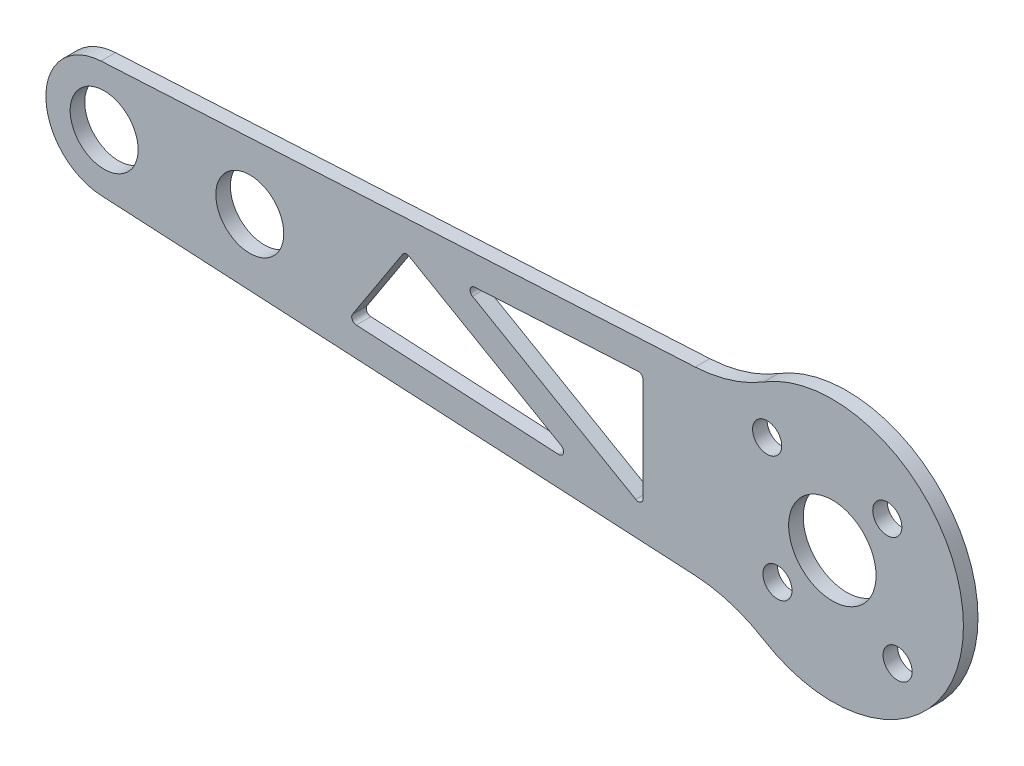
ISO-10303-21;
HEADER;
FILE_DESCRIPTION(('STEP AP214'),'2;1');
FILE_NAME('part.step','',(''),(''),'','','');
FILE_SCHEMA(('AUTOMOTIVE_DESIGN { 1 0 10303 214 1 1 1 1 }'));
ENDSEC;
DATA;
#1=APPLICATION_CONTEXT('core data for automotive mechanical design processes');
#2=APPLICATION_PROTOCOL_DEFINITION('international standard','automotive_design',2000,#1);
#3=PRODUCT_CONTEXT('',#1,'mechanical');
#4=PRODUCT('Part','Part','',(#3));
#5=PRODUCT_RELATED_PRODUCT_CATEGORY('part','',(#4));
#6=PRODUCT_DEFINITION_FORMATION('','',#4);
#7=PRODUCT_DEFINITION_CONTEXT('part definition',#1,'design');
#8=PRODUCT_DEFINITION('design','',#6,#7);
#9=PRODUCT_DEFINITION_SHAPE('','',#8);
#10=(LENGTH_UNIT() NAMED_UNIT(*) SI_UNIT(.MILLI.,.METRE.));
#11=(NAMED_UNIT(*) PLANE_ANGLE_UNIT() SI_UNIT($,.RADIAN.));
#12=(NAMED_UNIT(*) SI_UNIT($,.STERADIAN.) SOLID_ANGLE_UNIT());
#13=UNCERTAINTY_MEASURE_WITH_UNIT(LENGTH_MEASURE(1.E-05),#10,'distance_accuracy_value','');
#14=(GEOMETRIC_REPRESENTATION_CONTEXT(3) GLOBAL_UNCERTAINTY_ASSIGNED_CONTEXT((#13)) GLOBAL_UNIT_ASSIGNED_CONTEXT((#10,
#11,#12)) REPRESENTATION_CONTEXT('',''));
#15=CARTESIAN_POINT('',(0.,0.,0.));
#16=DIRECTION('',(0.,0.,1.));
#17=DIRECTION('',(1.,0.,0.));
#18=AXIS2_PLACEMENT_3D('',#15,#16,#17);
#19=CARTESIAN_POINT('',(-75.,0.,1.5));
#20=DIRECTION('',(0.,0.,1.));
#21=DIRECTION('',(1.,0.,0.));
#22=AXIS2_PLACEMENT_3D('',#19,#20,#21);
#23=PLANE('',#22);
#24=CARTESIAN_POINT('',(-60.,0.,1.5));
#25=DIRECTION('',(0.,0.,1.));
#26=DIRECTION('',(1.,0.,0.));
#27=AXIS2_PLACEMENT_3D('',#24,#25,#26);
#28=CIRCLE('',#27,3.50000000000001);
#29=CARTESIAN_POINT('',(-56.5,0.,1.5));
#30=VERTEX_POINT('',#29);
#31=EDGE_CURVE('E259',#30,#30,#28,.T.);
#32=ORIENTED_EDGE('',*,*,#31,.F.);
#33=EDGE_LOOP('',(#32));
#34=FACE_BOUND('',#33,.T.);
#35=CARTESIAN_POINT('',(6.71751442127221,-6.7175144212722,1.5));
#36=DIRECTION('',(0.,0.,1.));
#37=DIRECTION('',(-1.,0.,0.));
#38=AXIS2_PLACEMENT_3D('',#35,#36,#37);
#39=CIRCLE('',#38,1.50000000000001);
#40=CARTESIAN_POINT('',(5.2175144212722,-6.7175144212722,1.5));
#41=VERTEX_POINT('',#40);
#42=EDGE_CURVE('E271',#41,#41,#39,.T.);
#43=ORIENTED_EDGE('',*,*,#42,.F.);
#44=EDGE_LOOP('',(#43));
#45=FACE_BOUND('',#44,.T.);
#46=CARTESIAN_POINT('',(-6.7175144212722,6.7175144212722,1.5));
#47=DIRECTION('',(0.,0.,1.));
#48=DIRECTION('',(1.,0.,0.));
#49=AXIS2_PLACEMENT_3D('',#46,#47,#48);
#50=CIRCLE('',#49,1.5);
#51=CARTESIAN_POINT('',(-5.2175144212722,6.7175144212722,1.5));
#52=VERTEX_POINT('',#51);
#53=EDGE_CURVE('E283',#52,#52,#50,.T.);
#54=ORIENTED_EDGE('',*,*,#53,.F.);
#55=EDGE_LOOP('',(#54));
#56=FACE_BOUND('',#55,.T.);
#57=CARTESIAN_POINT('',(-75.,0.,1.5));
#58=DIRECTION('',(0.,0.,1.));
#59=DIRECTION('',(1.,0.,0.));
#60=AXIS2_PLACEMENT_3D('',#57,#58,#59);
#61=CIRCLE('',#60,6.);
#62=CARTESIAN_POINT('',(-75.3237721009453,5.99125793357701,1.5));
#63=VERTEX_POINT('',#62);
#64=CARTESIAN_POINT('',(-75.3237721009453,-5.99125793357701,1.5));
#65=VERTEX_POINT('',#64);
#66=EDGE_CURVE('E295',#63,#65,#61,.T.);
#67=ORIENTED_EDGE('',*,*,#66,.T.);
#68=DIRECTION('',(0.998542988929501,-0.0539620168242241,0.));
#69=VECTOR('',#68,1.);
#70=CARTESIAN_POINT('',(-14.1197870173961,-9.29876748439638,1.5));
#71=LINE('',#70,#69);
#72=CARTESIAN_POINT('',(-14.1197870173961,-9.29876748439638,1.5));
#73=VERTEX_POINT('',#72);
#74=EDGE_CURVE('E298',#65,#73,#71,.T.);
#75=ORIENTED_EDGE('',*,*,#74,.T.);
#76=CARTESIAN_POINT('',(-14.9292172697595,-24.2769123183389,1.5));
#77=DIRECTION('',(0.,0.,-1.));
#78=DIRECTION('',(-1.,0.,0.));
#79=AXIS2_PLACEMENT_3D('',#76,#77,#78);
#80=CIRCLE('',#79,15.);
#81=CARTESIAN_POINT('',(-7.07173449620185,-11.499590045529,1.5));
#82=VERTEX_POINT('',#81);
#83=EDGE_CURVE('E301',#73,#82,#80,.T.);
#84=ORIENTED_EDGE('',*,*,#83,.T.);
#85=CARTESIAN_POINT('',(0.,0.,1.5));
#86=DIRECTION('',(0.,0.,1.));
#87=DIRECTION('',(1.,0.,0.));
#88=AXIS2_PLACEMENT_3D('',#85,#86,#87);
#89=CIRCLE('',#88,13.5);
#90=CARTESIAN_POINT('',(-7.07173449620185,11.499590045529,1.5));
#91=VERTEX_POINT('',#90);
#92=EDGE_CURVE('E303',#82,#91,#89,.T.);
#93=ORIENTED_EDGE('',*,*,#92,.T.);
#94=CARTESIAN_POINT('',(-14.9292172697595,24.2769123183389,1.5));
#95=DIRECTION('',(0.,0.,-1.));
#96=DIRECTION('',(1.,0.,0.));
#97=AXIS2_PLACEMENT_3D('',#94,#95,#96);
#98=CIRCLE('',#97,15.);
#99=CARTESIAN_POINT('',(-14.1197870173961,9.29876748439638,1.5));
#100=VERTEX_POINT('',#99);
#101=EDGE_CURVE('E305',#91,#100,#98,.T.);
#102=ORIENTED_EDGE('',*,*,#101,.T.);
#103=DIRECTION('',(-0.998542988929501,-0.0539620168242241,0.));
#104=VECTOR('',#103,1.);
#105=CARTESIAN_POINT('',(-14.1197870173961,9.29876748439638,1.5));
#106=LINE('',#105,#104);
#107=EDGE_CURVE('E307',#100,#63,#106,.T.);
#108=ORIENTED_EDGE('',*,*,#107,.T.);
#109=EDGE_LOOP('',(#67,#75,#84,#93,#102,#108));
#110=FACE_BOUND('',#109,.T.);
#111=CARTESIAN_POINT('',(-5.65685424949237,-5.65685424949239,1.5));
#112=DIRECTION('',(0.,0.,1.));
#113=DIRECTION('',(1.,0.,0.));
#114=AXIS2_PLACEMENT_3D('',#111,#112,#113);
#115=CIRCLE('',#114,1.5);
#116=CARTESIAN_POINT('',(-4.15685424949237,-5.65685424949239,1.5));
#117=VERTEX_POINT('',#116);
#118=EDGE_CURVE('E289',#117,#117,#115,.T.);
#119=ORIENTED_EDGE('',*,*,#118,.F.);
#120=EDGE_LOOP('',(#119));
#121=FACE_BOUND('',#120,.T.);
#122=CARTESIAN_POINT('',(5.65685424949238,5.65685424949238,1.5));
#123=DIRECTION('',(0.,0.,1.));
#124=DIRECTION('',(-1.,0.,0.));
#125=AXIS2_PLACEMENT_3D('',#122,#123,#124);
#126=CIRCLE('',#125,1.5);
#127=CARTESIAN_POINT('',(4.15685424949238,5.65685424949238,1.5));
#128=VERTEX_POINT('',#127);
#129=EDGE_CURVE('E277',#128,#128,#126,.T.);
#130=ORIENTED_EDGE('',*,*,#129,.F.);
#131=EDGE_LOOP('',(#130));
#132=FACE_BOUND('',#131,.T.);
#133=CARTESIAN_POINT('',(0.,0.,1.5));
#134=DIRECTION('',(0.,0.,1.));
#135=DIRECTION('',(1.,0.,0.));
#136=AXIS2_PLACEMENT_3D('',#133,#134,#135);
#137=CIRCLE('',#136,4.5);
#138=CARTESIAN_POINT('',(4.5,0.,1.5));
#139=VERTEX_POINT('',#138);
#140=EDGE_CURVE('E265',#139,#139,#137,.T.);
#141=ORIENTED_EDGE('',*,*,#140,.F.);
#142=EDGE_LOOP('',(#141));
#143=FACE_BOUND('',#142,.T.);
#144=CARTESIAN_POINT('',(-75.,0.,1.5));
#145=DIRECTION('',(0.,0.,1.));
#146=DIRECTION('',(1.,0.,0.));
#147=AXIS2_PLACEMENT_3D('',#144,#145,#146);
#148=CIRCLE('',#147,3.50000000000001);
#149=CARTESIAN_POINT('',(-71.5,0.,1.5));
#150=VERTEX_POINT('',#149);
#151=EDGE_CURVE('E253',#150,#150,#148,.T.);
#152=ORIENTED_EDGE('',*,*,#151,.F.);
#153=EDGE_LOOP('',(#152));
#154=FACE_BOUND('',#153,.T.);
#155=DIRECTION('',(-0.546003971873975,-0.837782586771677,0.));
#156=VECTOR('',#155,1.);
#157=CARTESIAN_POINT('',(-49.4227006988099,-3.63549961839977,1.5));
#158=LINE('',#157,#156);
#159=CARTESIAN_POINT('',(-44.262290060557,4.28257863015466,1.5));
#160=VERTEX_POINT('',#159);
#161=CARTESIAN_POINT('',(-49.4227006988099,-3.63549961839977,1.5));
#162=VERTEX_POINT('',#161);
#163=EDGE_CURVE('E210',#160,#162,#158,.T.);
#164=ORIENTED_EDGE('',*,*,#163,.F.);
#165=CARTESIAN_POINT('',(-43.8433987671711,4.00957664421766,1.5));
#166=DIRECTION('',(0.,0.,1.));
#167=DIRECTION('',(1.,0.,0.));
#168=AXIS2_PLACEMENT_3D('',#165,#166,#167);
#169=CIRCLE('',#168,0.500000000000024);
#170=CARTESIAN_POINT('',(-43.5933987671711,4.44258934610989,1.5));
#171=VERTEX_POINT('',#170);
#172=EDGE_CURVE('E208',#171,#160,#169,.T.);
#173=ORIENTED_EDGE('',*,*,#172,.F.);
#174=DIRECTION('',(-0.866025403784437,0.500000000000004,0.));
#175=VECTOR('',#174,1.);
#176=CARTESIAN_POINT('',(-43.5933987671711,4.44258934610989,1.5));
#177=LINE('',#176,#175);
#178=CARTESIAN_POINT('',(-27.929722665026,-4.60083826796275,1.5));
#179=VERTEX_POINT('',#178);
#180=EDGE_CURVE('E220',#179,#171,#177,.T.);
#181=ORIENTED_EDGE('',*,*,#180,.F.);
#182=CARTESIAN_POINT('',(-28.179722665026,-5.033850969855,1.5));
#183=DIRECTION('',(0.,0.,1.));
#184=DIRECTION('',(1.,0.,0.));
#185=AXIS2_PLACEMENT_3D('',#182,#183,#184);
#186=CIRCLE('',#185,0.500000000000024);
#187=CARTESIAN_POINT('',(-28.2067036734382,-5.53312246431978,1.5));
#188=VERTEX_POINT('',#187);
#189=EDGE_CURVE('E217',#188,#179,#186,.T.);
#190=ORIENTED_EDGE('',*,*,#189,.F.);
#191=DIRECTION('',(0.998542988929501,-0.0539620168242242,0.));
#192=VECTOR('',#191,1.);
#193=CARTESIAN_POINT('',(-28.2067036734382,-5.53312246431978,1.5));
#194=LINE('',#193,#192);
#195=CARTESIAN_POINT('',(-49.0307904138362,-4.40777309880158,1.5));
#196=VERTEX_POINT('',#195);
#197=EDGE_CURVE('E215',#196,#188,#194,.T.);
#198=ORIENTED_EDGE('',*,*,#197,.F.);
#199=CARTESIAN_POINT('',(-49.0038094054241,-3.9085016043368,1.5));
#200=DIRECTION('',(0.,0.,1.));
#201=DIRECTION('',(1.,0.,0.));
#202=AXIS2_PLACEMENT_3D('',#199,#200,#201);
#203=CIRCLE('',#202,0.500000000000025);
#204=EDGE_CURVE('E213',#162,#196,#203,.T.);
#205=ORIENTED_EDGE('',*,*,#204,.F.);
#206=EDGE_LOOP('',(#164,#173,#181,#190,#198,#205));
#207=FACE_BOUND('',#206,.T.);
#208=DIRECTION('',(0.866025403784436,-0.500000000000004,0.));
#209=VECTOR('',#208,1.);
#210=CARTESIAN_POINT('',(-20.25,-5.57062660077947,1.5));
#211=LINE('',#210,#209);
#212=CARTESIAN_POINT('',(-37.0597151405972,4.13446696064533,1.5));
#213=VERTEX_POINT('',#212);
#214=CARTESIAN_POINT('',(-20.25,-5.57062660077947,1.5));
#215=VERTEX_POINT('',#214);
#216=EDGE_CURVE('E165',#213,#215,#211,.T.);
#217=ORIENTED_EDGE('',*,*,#216,.F.);
#218=CARTESIAN_POINT('',(-36.8097151405972,4.56747966253758,1.5));
#219=DIRECTION('',(0.,0.,1.));
#220=DIRECTION('',(-1.,0.,0.));
#221=AXIS2_PLACEMENT_3D('',#218,#219,#220);
#222=CIRCLE('',#221,0.500000000000026);
#223=CARTESIAN_POINT('',(-36.8366961490093,5.06675115700236,1.5));
#224=VERTEX_POINT('',#223);
#225=EDGE_CURVE('E157',#224,#213,#222,.T.);
#226=ORIENTED_EDGE('',*,*,#225,.F.);
#227=DIRECTION('',(-0.998542988929501,-0.0539620168242242,0.));
#228=VECTOR('',#227,1.);
#229=CARTESIAN_POINT('',(-36.8366961490093,5.06675115700236,1.5));
#230=LINE('',#229,#228);
#231=CARTESIAN_POINT('',(-20.0269810084121,5.97516085121069,1.5));
#232=VERTEX_POINT('',#231);
#233=EDGE_CURVE('E186',#232,#224,#230,.T.);
#234=ORIENTED_EDGE('',*,*,#233,.F.);
#235=CARTESIAN_POINT('',(-20.,5.47588935674591,1.5));
#236=DIRECTION('',(0.,0.,1.));
#237=DIRECTION('',(-1.,0.,0.));
#238=AXIS2_PLACEMENT_3D('',#235,#236,#237);
#239=CIRCLE('',#238,0.500000000000025);
#240=CARTESIAN_POINT('',(-19.5,5.47588935674591,1.5));
#241=VERTEX_POINT('',#240);
#242=EDGE_CURVE('E184',#241,#232,#239,.T.);
#243=ORIENTED_EDGE('',*,*,#242,.F.);
#244=DIRECTION('',(0.,1.,0.));
#245=VECTOR('',#244,1.);
#246=CARTESIAN_POINT('',(-19.5,5.47588935674591,1.5));
#247=LINE('',#246,#245);
#248=CARTESIAN_POINT('',(-19.5,-5.13761389888723,1.5));
#249=VERTEX_POINT('',#248);
#250=EDGE_CURVE('E180',#249,#241,#247,.T.);
#251=ORIENTED_EDGE('',*,*,#250,.F.);
#252=CARTESIAN_POINT('',(-20.,-5.13761389888723,1.5));
#253=DIRECTION('',(0.,0.,1.));
#254=DIRECTION('',(1.,0.,0.));
#255=AXIS2_PLACEMENT_3D('',#252,#253,#254);
#256=CIRCLE('',#255,0.500000000000028);
#257=EDGE_CURVE('E178',#215,#249,#256,.T.);
#258=ORIENTED_EDGE('',*,*,#257,.F.);
#259=EDGE_LOOP('',(#217,#226,#234,#243,#251,#258));
#260=FACE_BOUND('',#259,.T.);
#261=ADVANCED_FACE('F32',(#34,#45,#56,#110,#121,#132,#143,#154,#207,#260),#23,.T.);
#262=CARTESIAN_POINT('',(-75.,0.,0.));
#263=DIRECTION('',(0.,0.,1.));
#264=DIRECTION('',(1.,0.,0.));
#265=AXIS2_PLACEMENT_3D('',#262,#263,#264);
#266=PLANE('',#265);
#267=CARTESIAN_POINT('',(-43.8433987671711,4.00957664421766,0.));
#268=DIRECTION('',(0.,0.,1.));
#269=DIRECTION('',(1.,0.,0.));
#270=AXIS2_PLACEMENT_3D('',#267,#268,#269);
#271=CIRCLE('',#270,0.500000000000024);
#272=CARTESIAN_POINT('',(-43.5933987671711,4.44258934610989,0.));
#273=VERTEX_POINT('',#272);
#274=CARTESIAN_POINT('',(-44.262290060557,4.28257863015466,0.));
#275=VERTEX_POINT('',#274);
#276=EDGE_CURVE('E173',#273,#275,#271,.T.);
#277=ORIENTED_EDGE('',*,*,#276,.T.);
#278=DIRECTION('',(-0.546003971873975,-0.837782586771677,0.));
#279=VECTOR('',#278,1.);
#280=CARTESIAN_POINT('',(-49.4227006988099,-3.63549961839977,0.));
#281=LINE('',#280,#279);
#282=CARTESIAN_POINT('',(-49.4227006988099,-3.63549961839977,0.));
#283=VERTEX_POINT('',#282);
#284=EDGE_CURVE('E225',#275,#283,#281,.T.);
#285=ORIENTED_EDGE('',*,*,#284,.T.);
#286=CARTESIAN_POINT('',(-49.0038094054241,-3.9085016043368,0.));
#287=DIRECTION('',(0.,0.,1.));
#288=DIRECTION('',(1.,0.,0.));
#289=AXIS2_PLACEMENT_3D('',#286,#287,#288);
#290=CIRCLE('',#289,0.500000000000025);
#291=CARTESIAN_POINT('',(-49.0307904138362,-4.40777309880158,0.));
#292=VERTEX_POINT('',#291);
#293=EDGE_CURVE('E228',#283,#292,#290,.T.);
#294=ORIENTED_EDGE('',*,*,#293,.T.);
#295=DIRECTION('',(0.998542988929501,-0.0539620168242242,0.));
#296=VECTOR('',#295,1.);
#297=CARTESIAN_POINT('',(-28.2067036734382,-5.53312246431978,0.));
#298=LINE('',#297,#296);
#299=CARTESIAN_POINT('',(-28.2067036734382,-5.53312246431978,0.));
#300=VERTEX_POINT('',#299);
#301=EDGE_CURVE('E231',#292,#300,#298,.T.);
#302=ORIENTED_EDGE('',*,*,#301,.T.);
#303=CARTESIAN_POINT('',(-28.179722665026,-5.033850969855,0.));
#304=DIRECTION('',(0.,0.,1.));
#305=DIRECTION('',(1.,0.,0.));
#306=AXIS2_PLACEMENT_3D('',#303,#304,#305);
#307=CIRCLE('',#306,0.500000000000024);
#308=CARTESIAN_POINT('',(-27.929722665026,-4.60083826796275,0.));
#309=VERTEX_POINT('',#308);
#310=EDGE_CURVE('E234',#300,#309,#307,.T.);
#311=ORIENTED_EDGE('',*,*,#310,.T.);
#312=DIRECTION('',(-0.866025403784437,0.500000000000004,0.));
#313=VECTOR('',#312,1.);
#314=CARTESIAN_POINT('',(-43.5933987671711,4.44258934610989,0.));
#315=LINE('',#314,#313);
#316=EDGE_CURVE('E211',#309,#273,#315,.T.);
#317=ORIENTED_EDGE('',*,*,#316,.T.);
#318=EDGE_LOOP('',(#277,#285,#294,#302,#311,#317));
#319=FACE_BOUND('',#318,.T.);
#320=CARTESIAN_POINT('',(-75.,0.,0.));
#321=DIRECTION('',(0.,0.,1.));
#322=DIRECTION('',(1.,0.,0.));
#323=AXIS2_PLACEMENT_3D('',#320,#321,#322);
#324=CIRCLE('',#323,6.);
#325=CARTESIAN_POINT('',(-75.3237721009453,5.99125793357701,0.));
#326=VERTEX_POINT('',#325);
#327=CARTESIAN_POINT('',(-75.3237721009453,-5.99125793357701,0.));
#328=VERTEX_POINT('',#327);
#329=EDGE_CURVE('E292',#326,#328,#324,.T.);
#330=ORIENTED_EDGE('',*,*,#329,.F.);
#331=DIRECTION('',(-0.998542988929501,-0.0539620168242241,0.));
#332=VECTOR('',#331,1.);
#333=CARTESIAN_POINT('',(-14.1197870173961,9.29876748439638,0.));
#334=LINE('',#333,#332);
#335=CARTESIAN_POINT('',(-14.1197870173961,9.29876748439638,0.));
#336=VERTEX_POINT('',#335);
#337=EDGE_CURVE('E299',#336,#326,#334,.T.);
#338=ORIENTED_EDGE('',*,*,#337,.F.);
#339=CARTESIAN_POINT('',(-14.9292172697595,24.2769123183389,0.));
#340=DIRECTION('',(0.,0.,-1.));
#341=DIRECTION('',(1.,0.,0.));
#342=AXIS2_PLACEMENT_3D('',#339,#340,#341);
#343=CIRCLE('',#342,15.);
#344=CARTESIAN_POINT('',(-7.07173449620185,11.499590045529,0.));
#345=VERTEX_POINT('',#344);
#346=EDGE_CURVE('E318',#345,#336,#343,.T.);
#347=ORIENTED_EDGE('',*,*,#346,.F.);
#348=CARTESIAN_POINT('',(0.,0.,0.));
#349=DIRECTION('',(0.,0.,1.));
#350=DIRECTION('',(1.,0.,0.));
#351=AXIS2_PLACEMENT_3D('',#348,#349,#350);
#352=CIRCLE('',#351,13.5);
#353=CARTESIAN_POINT('',(-7.07173449620185,-11.499590045529,0.));
#354=VERTEX_POINT('',#353);
#355=EDGE_CURVE('E316',#354,#345,#352,.T.);
#356=ORIENTED_EDGE('',*,*,#355,.F.);
#357=CARTESIAN_POINT('',(-14.9292172697595,-24.2769123183389,0.));
#358=DIRECTION('',(0.,0.,-1.));
#359=DIRECTION('',(-1.,0.,0.));
#360=AXIS2_PLACEMENT_3D('',#357,#358,#359);
#361=CIRCLE('',#360,15.);
#362=CARTESIAN_POINT('',(-14.1197870173961,-9.29876748439638,0.));
#363=VERTEX_POINT('',#362);
#364=EDGE_CURVE('E314',#363,#354,#361,.T.);
#365=ORIENTED_EDGE('',*,*,#364,.F.);
#366=DIRECTION('',(0.998542988929501,-0.0539620168242241,0.));
#367=VECTOR('',#366,1.);
#368=CARTESIAN_POINT('',(-14.1197870173961,-9.29876748439638,0.));
#369=LINE('',#368,#367);
#370=EDGE_CURVE('E312',#328,#363,#369,.T.);
#371=ORIENTED_EDGE('',*,*,#370,.F.);
#372=EDGE_LOOP('',(#330,#338,#347,#356,#365,#371));
#373=FACE_BOUND('',#372,.T.);
#374=CARTESIAN_POINT('',(-5.65685424949237,-5.65685424949239,0.));
#375=DIRECTION('',(0.,0.,1.));
#376=DIRECTION('',(1.,0.,0.));
#377=AXIS2_PLACEMENT_3D('',#374,#375,#376);
#378=CIRCLE('',#377,1.5);
#379=CARTESIAN_POINT('',(-4.15685424949237,-5.65685424949239,0.));
#380=VERTEX_POINT('',#379);
#381=EDGE_CURVE('E286',#380,#380,#378,.T.);
#382=ORIENTED_EDGE('',*,*,#381,.T.);
#383=EDGE_LOOP('',(#382));
#384=FACE_BOUND('',#383,.T.);
#385=CARTESIAN_POINT('',(-6.7175144212722,6.7175144212722,0.));
#386=DIRECTION('',(0.,0.,1.));
#387=DIRECTION('',(1.,0.,0.));
#388=AXIS2_PLACEMENT_3D('',#385,#386,#387);
#389=CIRCLE('',#388,1.5);
#390=CARTESIAN_POINT('',(-5.2175144212722,6.7175144212722,0.));
#391=VERTEX_POINT('',#390);
#392=EDGE_CURVE('E280',#391,#391,#389,.T.);
#393=ORIENTED_EDGE('',*,*,#392,.T.);
#394=EDGE_LOOP('',(#393));
#395=FACE_BOUND('',#394,.T.);
#396=CARTESIAN_POINT('',(5.65685424949238,5.65685424949238,0.));
#397=DIRECTION('',(0.,0.,1.));
#398=DIRECTION('',(-1.,0.,0.));
#399=AXIS2_PLACEMENT_3D('',#396,#397,#398);
#400=CIRCLE('',#399,1.5);
#401=CARTESIAN_POINT('',(4.15685424949238,5.65685424949238,0.));
#402=VERTEX_POINT('',#401);
#403=EDGE_CURVE('E274',#402,#402,#400,.T.);
#404=ORIENTED_EDGE('',*,*,#403,.T.);
#405=EDGE_LOOP('',(#404));
#406=FACE_BOUND('',#405,.T.);
#407=CARTESIAN_POINT('',(6.71751442127221,-6.7175144212722,0.));
#408=DIRECTION('',(0.,0.,1.));
#409=DIRECTION('',(-1.,0.,0.));
#410=AXIS2_PLACEMENT_3D('',#407,#408,#409);
#411=CIRCLE('',#410,1.50000000000001);
#412=CARTESIAN_POINT('',(5.2175144212722,-6.7175144212722,0.));
#413=VERTEX_POINT('',#412);
#414=EDGE_CURVE('E268',#413,#413,#411,.T.);
#415=ORIENTED_EDGE('',*,*,#414,.T.);
#416=EDGE_LOOP('',(#415));
#417=FACE_BOUND('',#416,.T.);
#418=CARTESIAN_POINT('',(0.,0.,0.));
#419=DIRECTION('',(0.,0.,1.));
#420=DIRECTION('',(1.,0.,0.));
#421=AXIS2_PLACEMENT_3D('',#418,#419,#420);
#422=CIRCLE('',#421,4.5);
#423=CARTESIAN_POINT('',(4.5,0.,0.));
#424=VERTEX_POINT('',#423);
#425=EDGE_CURVE('E262',#424,#424,#422,.T.);
#426=ORIENTED_EDGE('',*,*,#425,.T.);
#427=EDGE_LOOP('',(#426));
#428=FACE_BOUND('',#427,.T.);
#429=CARTESIAN_POINT('',(-60.,0.,0.));
#430=DIRECTION('',(0.,0.,1.));
#431=DIRECTION('',(1.,0.,0.));
#432=AXIS2_PLACEMENT_3D('',#429,#430,#431);
#433=CIRCLE('',#432,3.50000000000001);
#434=CARTESIAN_POINT('',(-56.5,0.,0.));
#435=VERTEX_POINT('',#434);
#436=EDGE_CURVE('E256',#435,#435,#433,.T.);
#437=ORIENTED_EDGE('',*,*,#436,.T.);
#438=EDGE_LOOP('',(#437));
#439=FACE_BOUND('',#438,.T.);
#440=CARTESIAN_POINT('',(-75.,0.,0.));
#441=DIRECTION('',(0.,0.,1.));
#442=DIRECTION('',(1.,0.,0.));
#443=AXIS2_PLACEMENT_3D('',#440,#441,#442);
#444=CIRCLE('',#443,3.50000000000001);
#445=CARTESIAN_POINT('',(-71.5,0.,0.));
#446=VERTEX_POINT('',#445);
#447=EDGE_CURVE('E252',#446,#446,#444,.T.);
#448=ORIENTED_EDGE('',*,*,#447,.T.);
#449=EDGE_LOOP('',(#448));
#450=FACE_BOUND('',#449,.T.);
#451=CARTESIAN_POINT('',(-36.8097151405972,4.56747966253758,0.));
#452=DIRECTION('',(0.,0.,1.));
#453=DIRECTION('',(-1.,0.,0.));
#454=AXIS2_PLACEMENT_3D('',#451,#452,#453);
#455=CIRCLE('',#454,0.500000000000026);
#456=CARTESIAN_POINT('',(-36.8366961490093,5.06675115700236,0.));
#457=VERTEX_POINT('',#456);
#458=CARTESIAN_POINT('',(-37.0597151405972,4.13446696064533,0.));
#459=VERTEX_POINT('',#458);
#460=EDGE_CURVE('E55',#457,#459,#455,.T.);
#461=ORIENTED_EDGE('',*,*,#460,.T.);
#462=DIRECTION('',(0.866025403784436,-0.500000000000004,0.));
#463=VECTOR('',#462,1.);
#464=CARTESIAN_POINT('',(-20.25,-5.57062660077947,0.));
#465=LINE('',#464,#463);
#466=CARTESIAN_POINT('',(-20.25,-5.57062660077947,0.));
#467=VERTEX_POINT('',#466);
#468=EDGE_CURVE('E172',#459,#467,#465,.T.);
#469=ORIENTED_EDGE('',*,*,#468,.T.);
#470=CARTESIAN_POINT('',(-20.,-5.13761389888723,0.));
#471=DIRECTION('',(0.,0.,1.));
#472=DIRECTION('',(1.,0.,0.));
#473=AXIS2_PLACEMENT_3D('',#470,#471,#472);
#474=CIRCLE('',#473,0.500000000000028);
#475=CARTESIAN_POINT('',(-19.5,-5.13761389888723,0.));
#476=VERTEX_POINT('',#475);
#477=EDGE_CURVE('E190',#467,#476,#474,.T.);
#478=ORIENTED_EDGE('',*,*,#477,.T.);
#479=DIRECTION('',(0.,1.,0.));
#480=VECTOR('',#479,1.);
#481=CARTESIAN_POINT('',(-19.5,5.47588935674591,0.));
#482=LINE('',#481,#480);
#483=CARTESIAN_POINT('',(-19.5,5.47588935674591,0.));
#484=VERTEX_POINT('',#483);
#485=EDGE_CURVE('E193',#476,#484,#482,.T.);
#486=ORIENTED_EDGE('',*,*,#485,.T.);
#487=CARTESIAN_POINT('',(-20.,5.47588935674591,0.));
#488=DIRECTION('',(0.,0.,1.));
#489=DIRECTION('',(-1.,0.,0.));
#490=AXIS2_PLACEMENT_3D('',#487,#488,#489);
#491=CIRCLE('',#490,0.500000000000025);
#492=CARTESIAN_POINT('',(-20.0269810084121,5.97516085121069,0.));
#493=VERTEX_POINT('',#492);
#494=EDGE_CURVE('E196',#484,#493,#491,.T.);
#495=ORIENTED_EDGE('',*,*,#494,.T.);
#496=DIRECTION('',(-0.998542988929501,-0.0539620168242242,0.));
#497=VECTOR('',#496,1.);
#498=CARTESIAN_POINT('',(-36.8366961490093,5.06675115700236,0.));
#499=LINE('',#498,#497);
#500=EDGE_CURVE('E166',#493,#457,#499,.T.);
#501=ORIENTED_EDGE('',*,*,#500,.T.);
#502=EDGE_LOOP('',(#461,#469,#478,#486,#495,#501));
#503=FACE_BOUND('',#502,.T.);
#504=ADVANCED_FACE('F342',(#319,#373,#384,#395,#406,#417,#428,#439,#450,#503),#266,.F.);
#505=CARTESIAN_POINT('',(-75.,0.,1.5));
#506=DIRECTION('',(0.,0.,-1.));
#507=DIRECTION('',(-1.,0.,0.));
#508=AXIS2_PLACEMENT_3D('',#505,#506,#507);
#509=CYLINDRICAL_SURFACE('',#508,6.);
#510=ORIENTED_EDGE('',*,*,#329,.T.);
#511=DIRECTION('',(0.,0.,-1.));
#512=VECTOR('',#511,1.);
#513=CARTESIAN_POINT('',(-75.3237721009453,-5.99125793357701,1.5));
#514=LINE('',#513,#512);
#515=EDGE_CURVE('E11',#65,#328,#514,.T.);
#516=ORIENTED_EDGE('',*,*,#515,.F.);
#517=ORIENTED_EDGE('',*,*,#66,.F.);
#518=DIRECTION('',(0.,0.,-1.));
#519=VECTOR('',#518,1.);
#520=CARTESIAN_POINT('',(-75.3237721009453,5.99125793357701,1.5));
#521=LINE('',#520,#519);
#522=EDGE_CURVE('E309',#63,#326,#521,.T.);
#523=ORIENTED_EDGE('',*,*,#522,.T.);
#524=EDGE_LOOP('',(#510,#516,#517,#523));
#525=FACE_BOUND('',#524,.T.);
#526=ADVANCED_FACE('F34',(#525),#509,.T.);
#527=CARTESIAN_POINT('',(-14.1197870173961,-9.29876748439638,1.5));
#528=DIRECTION('',(0.0539620168242241,0.998542988929501,0.));
#529=DIRECTION('',(-0.998542988929501,0.0539620168242242,0.));
#530=AXIS2_PLACEMENT_3D('',#527,#528,#529);
#531=PLANE('',#530);
#532=ORIENTED_EDGE('',*,*,#370,.T.);
#533=DIRECTION('',(0.,0.,-1.));
#534=VECTOR('',#533,1.);
#535=CARTESIAN_POINT('',(-14.1197870173961,-9.29876748439638,1.5));
#536=LINE('',#535,#534);
#537=EDGE_CURVE('E40',#73,#363,#536,.T.);
#538=ORIENTED_EDGE('',*,*,#537,.F.);
#539=ORIENTED_EDGE('',*,*,#74,.F.);
#540=ORIENTED_EDGE('',*,*,#515,.T.);
#541=EDGE_LOOP('',(#532,#538,#539,#540));
#542=FACE_BOUND('',#541,.T.);
#543=ADVANCED_FACE('F360',(#542),#531,.F.);
#544=CARTESIAN_POINT('',(-14.9292172697595,-24.2769123183389,1.5));
#545=DIRECTION('',(0.,0.,-1.));
#546=DIRECTION('',(-1.,0.,0.));
#547=AXIS2_PLACEMENT_3D('',#544,#545,#546);
#548=CYLINDRICAL_SURFACE('',#547,15.);
#549=ORIENTED_EDGE('',*,*,#364,.T.);
#550=DIRECTION('',(0.,0.,-1.));
#551=VECTOR('',#550,1.);
#552=CARTESIAN_POINT('',(-7.07173449620185,-11.499590045529,1.5));
#553=LINE('',#552,#551);
#554=EDGE_CURVE('E329',#82,#354,#553,.T.);
#555=ORIENTED_EDGE('',*,*,#554,.F.);
#556=ORIENTED_EDGE('',*,*,#83,.F.);
#557=ORIENTED_EDGE('',*,*,#537,.T.);
#558=EDGE_LOOP('',(#549,#555,#556,#557));
#559=FACE_BOUND('',#558,.T.);
#560=ADVANCED_FACE('F336',(#559),#548,.F.);
#561=CARTESIAN_POINT('',(0.,0.,1.5));
#562=DIRECTION('',(0.,0.,-1.));
#563=DIRECTION('',(-1.,0.,0.));
#564=AXIS2_PLACEMENT_3D('',#561,#562,#563);
#565=CYLINDRICAL_SURFACE('',#564,13.5);
#566=ORIENTED_EDGE('',*,*,#355,.T.);
#567=DIRECTION('',(0.,0.,-1.));
#568=VECTOR('',#567,1.);
#569=CARTESIAN_POINT('',(-7.07173449620185,11.499590045529,1.5));
#570=LINE('',#569,#568);
#571=EDGE_CURVE('E326',#91,#345,#570,.T.);
#572=ORIENTED_EDGE('',*,*,#571,.F.);
#573=ORIENTED_EDGE('',*,*,#92,.F.);
#574=ORIENTED_EDGE('',*,*,#554,.T.);
#575=EDGE_LOOP('',(#566,#572,#573,#574));
#576=FACE_BOUND('',#575,.T.);
#577=ADVANCED_FACE('F348',(#576),#565,.T.);
#578=CARTESIAN_POINT('',(-14.9292172697595,24.2769123183389,1.5));
#579=DIRECTION('',(0.,0.,-1.));
#580=DIRECTION('',(-1.,0.,0.));
#581=AXIS2_PLACEMENT_3D('',#578,#579,#580);
#582=CYLINDRICAL_SURFACE('',#581,15.);
#583=ORIENTED_EDGE('',*,*,#346,.T.);
#584=DIRECTION('',(0.,0.,-1.));
#585=VECTOR('',#584,1.);
#586=CARTESIAN_POINT('',(-14.1197870173961,9.29876748439638,1.5));
#587=LINE('',#586,#585);
#588=EDGE_CURVE('E323',#100,#336,#587,.T.);
#589=ORIENTED_EDGE('',*,*,#588,.F.);
#590=ORIENTED_EDGE('',*,*,#101,.F.);
#591=ORIENTED_EDGE('',*,*,#571,.T.);
#592=EDGE_LOOP('',(#583,#589,#590,#591));
#593=FACE_BOUND('',#592,.T.);
#594=ADVANCED_FACE('F352',(#593),#582,.F.);
#595=CARTESIAN_POINT('',(-14.1197870173961,9.29876748439638,1.5));
#596=DIRECTION('',(0.0539620168242241,-0.998542988929501,0.));
#597=DIRECTION('',(0.998542988929501,0.0539620168242242,0.));
#598=AXIS2_PLACEMENT_3D('',#595,#596,#597);
#599=PLANE('',#598);
#600=ORIENTED_EDGE('',*,*,#337,.T.);
#601=ORIENTED_EDGE('',*,*,#522,.F.);
#602=ORIENTED_EDGE('',*,*,#107,.F.);
#603=ORIENTED_EDGE('',*,*,#588,.T.);
#604=EDGE_LOOP('',(#600,#601,#602,#603));
#605=FACE_BOUND('',#604,.T.);
#606=ADVANCED_FACE('F363',(#605),#599,.F.);
#607=CARTESIAN_POINT('',(-5.65685424949237,-5.65685424949239,1.5));
#608=DIRECTION('',(0.,0.,-1.));
#609=DIRECTION('',(-1.,0.,0.));
#610=AXIS2_PLACEMENT_3D('',#607,#608,#609);
#611=CYLINDRICAL_SURFACE('',#610,1.5);
#612=ORIENTED_EDGE('',*,*,#118,.T.);
#613=EDGE_LOOP('',(#612));
#614=FACE_BOUND('',#613,.T.);
#615=ORIENTED_EDGE('',*,*,#381,.F.);
#616=EDGE_LOOP('',(#615));
#617=FACE_BOUND('',#616,.T.);
#618=ADVANCED_FACE('F365',(#614,#617),#611,.F.);
#619=CARTESIAN_POINT('',(-6.7175144212722,6.7175144212722,1.5));
#620=DIRECTION('',(0.,0.,-1.));
#621=DIRECTION('',(-1.,0.,0.));
#622=AXIS2_PLACEMENT_3D('',#619,#620,#621);
#623=CYLINDRICAL_SURFACE('',#622,1.5);
#624=ORIENTED_EDGE('',*,*,#53,.T.);
#625=EDGE_LOOP('',(#624));
#626=FACE_BOUND('',#625,.T.);
#627=ORIENTED_EDGE('',*,*,#392,.F.);
#628=EDGE_LOOP('',(#627));
#629=FACE_BOUND('',#628,.T.);
#630=ADVANCED_FACE('F371',(#626,#629),#623,.F.);
#631=CARTESIAN_POINT('',(5.65685424949238,5.65685424949238,1.5));
#632=DIRECTION('',(0.,0.,-1.));
#633=DIRECTION('',(-1.,0.,0.));
#634=AXIS2_PLACEMENT_3D('',#631,#632,#633);
#635=CYLINDRICAL_SURFACE('',#634,1.5);
#636=ORIENTED_EDGE('',*,*,#129,.T.);
#637=EDGE_LOOP('',(#636));
#638=FACE_BOUND('',#637,.T.);
#639=ORIENTED_EDGE('',*,*,#403,.F.);
#640=EDGE_LOOP('',(#639));
#641=FACE_BOUND('',#640,.T.);
#642=ADVANCED_FACE('F388',(#638,#641),#635,.F.);
#643=CARTESIAN_POINT('',(6.71751442127221,-6.7175144212722,1.5));
#644=DIRECTION('',(0.,0.,-1.));
#645=DIRECTION('',(-1.,0.,0.));
#646=AXIS2_PLACEMENT_3D('',#643,#644,#645);
#647=CYLINDRICAL_SURFACE('',#646,1.50000000000001);
#648=ORIENTED_EDGE('',*,*,#42,.T.);
#649=EDGE_LOOP('',(#648));
#650=FACE_BOUND('',#649,.T.);
#651=ORIENTED_EDGE('',*,*,#414,.F.);
#652=EDGE_LOOP('',(#651));
#653=FACE_BOUND('',#652,.T.);
#654=ADVANCED_FACE('F392',(#650,#653),#647,.F.);
#655=CARTESIAN_POINT('',(0.,0.,1.5));
#656=DIRECTION('',(0.,0.,-1.));
#657=DIRECTION('',(-1.,0.,0.));
#658=AXIS2_PLACEMENT_3D('',#655,#656,#657);
#659=CYLINDRICAL_SURFACE('',#658,4.5);
#660=ORIENTED_EDGE('',*,*,#140,.T.);
#661=EDGE_LOOP('',(#660));
#662=FACE_BOUND('',#661,.T.);
#663=ORIENTED_EDGE('',*,*,#425,.F.);
#664=EDGE_LOOP('',(#663));
#665=FACE_BOUND('',#664,.T.);
#666=ADVANCED_FACE('F396',(#662,#665),#659,.F.);
#667=CARTESIAN_POINT('',(-60.,0.,1.5));
#668=DIRECTION('',(0.,0.,-1.));
#669=DIRECTION('',(-1.,0.,0.));
#670=AXIS2_PLACEMENT_3D('',#667,#668,#669);
#671=CYLINDRICAL_SURFACE('',#670,3.50000000000001);
#672=ORIENTED_EDGE('',*,*,#31,.T.);
#673=EDGE_LOOP('',(#672));
#674=FACE_BOUND('',#673,.T.);
#675=ORIENTED_EDGE('',*,*,#436,.F.);
#676=EDGE_LOOP('',(#675));
#677=FACE_BOUND('',#676,.T.);
#678=ADVANCED_FACE('F400',(#674,#677),#671,.F.);
#679=CARTESIAN_POINT('',(-75.,0.,1.5));
#680=DIRECTION('',(0.,0.,-1.));
#681=DIRECTION('',(-1.,0.,0.));
#682=AXIS2_PLACEMENT_3D('',#679,#680,#681);
#683=CYLINDRICAL_SURFACE('',#682,3.50000000000001);
#684=ORIENTED_EDGE('',*,*,#151,.T.);
#685=EDGE_LOOP('',(#684));
#686=FACE_BOUND('',#685,.T.);
#687=ORIENTED_EDGE('',*,*,#447,.F.);
#688=EDGE_LOOP('',(#687));
#689=FACE_BOUND('',#688,.T.);
#690=ADVANCED_FACE('F404',(#686,#689),#683,.F.);
#691=CARTESIAN_POINT('',(-43.8433987671711,4.00957664421766,1.5));
#692=DIRECTION('',(0.,0.,-1.));
#693=DIRECTION('',(-1.,0.,0.));
#694=AXIS2_PLACEMENT_3D('',#691,#692,#693);
#695=CYLINDRICAL_SURFACE('',#694,0.500000000000024);
#696=ORIENTED_EDGE('',*,*,#276,.F.);
#697=DIRECTION('',(0.,0.,-1.));
#698=VECTOR('',#697,1.);
#699=CARTESIAN_POINT('',(-43.5933987671711,4.44258934610989,1.5));
#700=LINE('',#699,#698);
#701=EDGE_CURVE('E222',#171,#273,#700,.T.);
#702=ORIENTED_EDGE('',*,*,#701,.F.);
#703=ORIENTED_EDGE('',*,*,#172,.T.);
#704=DIRECTION('',(0.,0.,-1.));
#705=VECTOR('',#704,1.);
#706=CARTESIAN_POINT('',(-44.262290060557,4.28257863015466,1.5));
#707=LINE('',#706,#705);
#708=EDGE_CURVE('E249',#160,#275,#707,.T.);
#709=ORIENTED_EDGE('',*,*,#708,.T.);
#710=EDGE_LOOP('',(#696,#702,#703,#709));
#711=FACE_BOUND('',#710,.T.);
#712=ADVANCED_FACE('F408',(#711),#695,.F.);
#713=CARTESIAN_POINT('',(-49.4227006988099,-3.63549961839977,1.5));
#714=DIRECTION('',(0.837782586771677,-0.546003971873975,0.));
#715=DIRECTION('',(0.546003971873976,0.837782586771677,0.));
#716=AXIS2_PLACEMENT_3D('',#713,#714,#715);
#717=PLANE('',#716);
#718=ORIENTED_EDGE('',*,*,#284,.F.);
#719=ORIENTED_EDGE('',*,*,#708,.F.);
#720=ORIENTED_EDGE('',*,*,#163,.T.);
#721=DIRECTION('',(0.,0.,-1.));
#722=VECTOR('',#721,1.);
#723=CARTESIAN_POINT('',(-49.4227006988099,-3.63549961839977,1.5));
#724=LINE('',#723,#722);
#725=EDGE_CURVE('E247',#162,#283,#724,.T.);
#726=ORIENTED_EDGE('',*,*,#725,.T.);
#727=EDGE_LOOP('',(#718,#719,#720,#726));
#728=FACE_BOUND('',#727,.T.);
#729=ADVANCED_FACE('F412',(#728),#717,.T.);
#730=CARTESIAN_POINT('',(-49.0038094054241,-3.9085016043368,1.5));
#731=DIRECTION('',(0.,0.,-1.));
#732=DIRECTION('',(-1.,0.,0.));
#733=AXIS2_PLACEMENT_3D('',#730,#731,#732);
#734=CYLINDRICAL_SURFACE('',#733,0.500000000000025);
#735=ORIENTED_EDGE('',*,*,#293,.F.);
#736=ORIENTED_EDGE('',*,*,#725,.F.);
#737=ORIENTED_EDGE('',*,*,#204,.T.);
#738=DIRECTION('',(0.,0.,-1.));
#739=VECTOR('',#738,1.);
#740=CARTESIAN_POINT('',(-49.0307904138362,-4.40777309880158,1.5));
#741=LINE('',#740,#739);
#742=EDGE_CURVE('E245',#196,#292,#741,.T.);
#743=ORIENTED_EDGE('',*,*,#742,.T.);
#744=EDGE_LOOP('',(#735,#736,#737,#743));
#745=FACE_BOUND('',#744,.T.);
#746=ADVANCED_FACE('F416',(#745),#734,.F.);
#747=CARTESIAN_POINT('',(-28.2067036734382,-5.53312246431978,1.5));
#748=DIRECTION('',(0.0539620168242242,0.998542988929501,0.));
#749=DIRECTION('',(-0.998542988929501,0.0539620168242242,0.));
#750=AXIS2_PLACEMENT_3D('',#747,#748,#749);
#751=PLANE('',#750);
#752=ORIENTED_EDGE('',*,*,#301,.F.);
#753=ORIENTED_EDGE('',*,*,#742,.F.);
#754=ORIENTED_EDGE('',*,*,#197,.T.);
#755=DIRECTION('',(0.,0.,-1.));
#756=VECTOR('',#755,1.);
#757=CARTESIAN_POINT('',(-28.2067036734382,-5.53312246431978,1.5));
#758=LINE('',#757,#756);
#759=EDGE_CURVE('E243',#188,#300,#758,.T.);
#760=ORIENTED_EDGE('',*,*,#759,.T.);
#761=EDGE_LOOP('',(#752,#753,#754,#760));
#762=FACE_BOUND('',#761,.T.);
#763=ADVANCED_FACE('F420',(#762),#751,.T.);
#764=CARTESIAN_POINT('',(-28.179722665026,-5.033850969855,1.5));
#765=DIRECTION('',(0.,0.,-1.));
#766=DIRECTION('',(-1.,0.,0.));
#767=AXIS2_PLACEMENT_3D('',#764,#765,#766);
#768=CYLINDRICAL_SURFACE('',#767,0.500000000000024);
#769=ORIENTED_EDGE('',*,*,#310,.F.);
#770=ORIENTED_EDGE('',*,*,#759,.F.);
#771=ORIENTED_EDGE('',*,*,#189,.T.);
#772=DIRECTION('',(0.,0.,-1.));
#773=VECTOR('',#772,1.);
#774=CARTESIAN_POINT('',(-27.929722665026,-4.60083826796275,1.5));
#775=LINE('',#774,#773);
#776=EDGE_CURVE('E241',#179,#309,#775,.T.);
#777=ORIENTED_EDGE('',*,*,#776,.T.);
#778=EDGE_LOOP('',(#769,#770,#771,#777));
#779=FACE_BOUND('',#778,.T.);
#780=ADVANCED_FACE('F424',(#779),#768,.F.);
#781=CARTESIAN_POINT('',(-43.5933987671711,4.44258934610989,1.5));
#782=DIRECTION('',(-0.500000000000004,-0.866025403784437,0.));
#783=DIRECTION('',(0.866025403784437,-0.500000000000004,0.));
#784=AXIS2_PLACEMENT_3D('',#781,#782,#783);
#785=PLANE('',#784);
#786=ORIENTED_EDGE('',*,*,#316,.F.);
#787=ORIENTED_EDGE('',*,*,#776,.F.);
#788=ORIENTED_EDGE('',*,*,#180,.T.);
#789=ORIENTED_EDGE('',*,*,#701,.T.);
#790=EDGE_LOOP('',(#786,#787,#788,#789));
#791=FACE_BOUND('',#790,.T.);
#792=ADVANCED_FACE('F428',(#791),#785,.T.);
#793=CARTESIAN_POINT('',(-36.8097151405972,4.56747966253758,1.5));
#794=DIRECTION('',(0.,0.,-1.));
#795=DIRECTION('',(-1.,0.,0.));
#796=AXIS2_PLACEMENT_3D('',#793,#794,#795);
#797=CYLINDRICAL_SURFACE('',#796,0.500000000000026);
#798=ORIENTED_EDGE('',*,*,#460,.F.);
#799=DIRECTION('',(0.,0.,-1.));
#800=VECTOR('',#799,1.);
#801=CARTESIAN_POINT('',(-36.8366961490093,5.06675115700236,1.5));
#802=LINE('',#801,#800);
#803=EDGE_CURVE('E161',#224,#457,#802,.T.);
#804=ORIENTED_EDGE('',*,*,#803,.F.);
#805=ORIENTED_EDGE('',*,*,#225,.T.);
#806=DIRECTION('',(0.,0.,-1.));
#807=VECTOR('',#806,1.);
#808=CARTESIAN_POINT('',(-37.0597151405972,4.13446696064533,1.5));
#809=LINE('',#808,#807);
#810=EDGE_CURVE('E160',#213,#459,#809,.T.);
#811=ORIENTED_EDGE('',*,*,#810,.T.);
#812=EDGE_LOOP('',(#798,#804,#805,#811));
#813=FACE_BOUND('',#812,.T.);
#814=ADVANCED_FACE('F159',(#813),#797,.F.);
#815=CARTESIAN_POINT('',(-20.25,-5.57062660077947,1.5));
#816=DIRECTION('',(0.500000000000004,0.866025403784436,0.));
#817=DIRECTION('',(-0.866025403784436,0.500000000000004,0.));
#818=AXIS2_PLACEMENT_3D('',#815,#816,#817);
#819=PLANE('',#818);
#820=ORIENTED_EDGE('',*,*,#468,.F.);
#821=ORIENTED_EDGE('',*,*,#810,.F.);
#822=ORIENTED_EDGE('',*,*,#216,.T.);
#823=DIRECTION('',(0.,0.,-1.));
#824=VECTOR('',#823,1.);
#825=CARTESIAN_POINT('',(-20.25,-5.57062660077947,1.5));
#826=LINE('',#825,#824);
#827=EDGE_CURVE('E174',#215,#467,#826,.T.);
#828=ORIENTED_EDGE('',*,*,#827,.T.);
#829=EDGE_LOOP('',(#820,#821,#822,#828));
#830=FACE_BOUND('',#829,.T.);
#831=ADVANCED_FACE('F169',(#830),#819,.T.);
#832=CARTESIAN_POINT('',(-20.,-5.13761389888723,1.5));
#833=DIRECTION('',(0.,0.,-1.));
#834=DIRECTION('',(-1.,0.,0.));
#835=AXIS2_PLACEMENT_3D('',#832,#833,#834);
#836=CYLINDRICAL_SURFACE('',#835,0.500000000000028);
#837=ORIENTED_EDGE('',*,*,#477,.F.);
#838=ORIENTED_EDGE('',*,*,#827,.F.);
#839=ORIENTED_EDGE('',*,*,#257,.T.);
#840=DIRECTION('',(0.,0.,-1.));
#841=VECTOR('',#840,1.);
#842=CARTESIAN_POINT('',(-19.5,-5.13761389888723,1.5));
#843=LINE('',#842,#841);
#844=EDGE_CURVE('E205',#249,#476,#843,.T.);
#845=ORIENTED_EDGE('',*,*,#844,.T.);
#846=EDGE_LOOP('',(#837,#838,#839,#845));
#847=FACE_BOUND('',#846,.T.);
#848=ADVANCED_FACE('F437',(#847),#836,.F.);
#849=CARTESIAN_POINT('',(-19.5,5.47588935674591,1.5));
#850=DIRECTION('',(-1.,0.,0.));
#851=DIRECTION('',(0.,-1.,0.));
#852=AXIS2_PLACEMENT_3D('',#849,#850,#851);
#853=PLANE('',#852);
#854=ORIENTED_EDGE('',*,*,#485,.F.);
#855=ORIENTED_EDGE('',*,*,#844,.F.);
#856=ORIENTED_EDGE('',*,*,#250,.T.);
#857=DIRECTION('',(0.,0.,-1.));
#858=VECTOR('',#857,1.);
#859=CARTESIAN_POINT('',(-19.5,5.47588935674591,1.5));
#860=LINE('',#859,#858);
#861=EDGE_CURVE('E203',#241,#484,#860,.T.);
#862=ORIENTED_EDGE('',*,*,#861,.T.);
#863=EDGE_LOOP('',(#854,#855,#856,#862));
#864=FACE_BOUND('',#863,.T.);
#865=ADVANCED_FACE('F440',(#864),#853,.T.);
#866=CARTESIAN_POINT('',(-20.,5.47588935674591,1.5));
#867=DIRECTION('',(0.,0.,-1.));
#868=DIRECTION('',(-1.,0.,0.));
#869=AXIS2_PLACEMENT_3D('',#866,#867,#868);
#870=CYLINDRICAL_SURFACE('',#869,0.500000000000025);
#871=ORIENTED_EDGE('',*,*,#494,.F.);
#872=ORIENTED_EDGE('',*,*,#861,.F.);
#873=ORIENTED_EDGE('',*,*,#242,.T.);
#874=DIRECTION('',(0.,0.,-1.));
#875=VECTOR('',#874,1.);
#876=CARTESIAN_POINT('',(-20.0269810084121,5.97516085121069,1.5));
#877=LINE('',#876,#875);
#878=EDGE_CURVE('E47',#232,#493,#877,.T.);
#879=ORIENTED_EDGE('',*,*,#878,.T.);
#880=EDGE_LOOP('',(#871,#872,#873,#879));
#881=FACE_BOUND('',#880,.T.);
#882=ADVANCED_FACE('F444',(#881),#870,.F.);
#883=CARTESIAN_POINT('',(-36.8366961490093,5.06675115700236,1.5));
#884=DIRECTION('',(0.0539620168242242,-0.998542988929501,0.));
#885=DIRECTION('',(0.998542988929501,0.0539620168242242,0.));
#886=AXIS2_PLACEMENT_3D('',#883,#884,#885);
#887=PLANE('',#886);
#888=ORIENTED_EDGE('',*,*,#500,.F.);
#889=ORIENTED_EDGE('',*,*,#878,.F.);
#890=ORIENTED_EDGE('',*,*,#233,.T.);
#891=ORIENTED_EDGE('',*,*,#803,.T.);
#892=EDGE_LOOP('',(#888,#889,#890,#891));
#893=FACE_BOUND('',#892,.T.);
#894=ADVANCED_FACE('F448',(#893),#887,.T.);
#895=CLOSED_SHELL('',(#261,#504,#526,#543,#560,#577,#594,#606,#618,#630,#642,#654,#666,#678,
#690,#712,#729,#746,#763,#780,#792,#814,#831,#848,#865,#882,#894));
#896=MANIFOLD_SOLID_BREP('B2',#895);
#897=ADVANCED_BREP_SHAPE_REPRESENTATION('',(#18,#896),#14);
#898=SHAPE_DEFINITION_REPRESENTATION(#9,#897);
ENDSEC;
END-ISO-10303-21;
